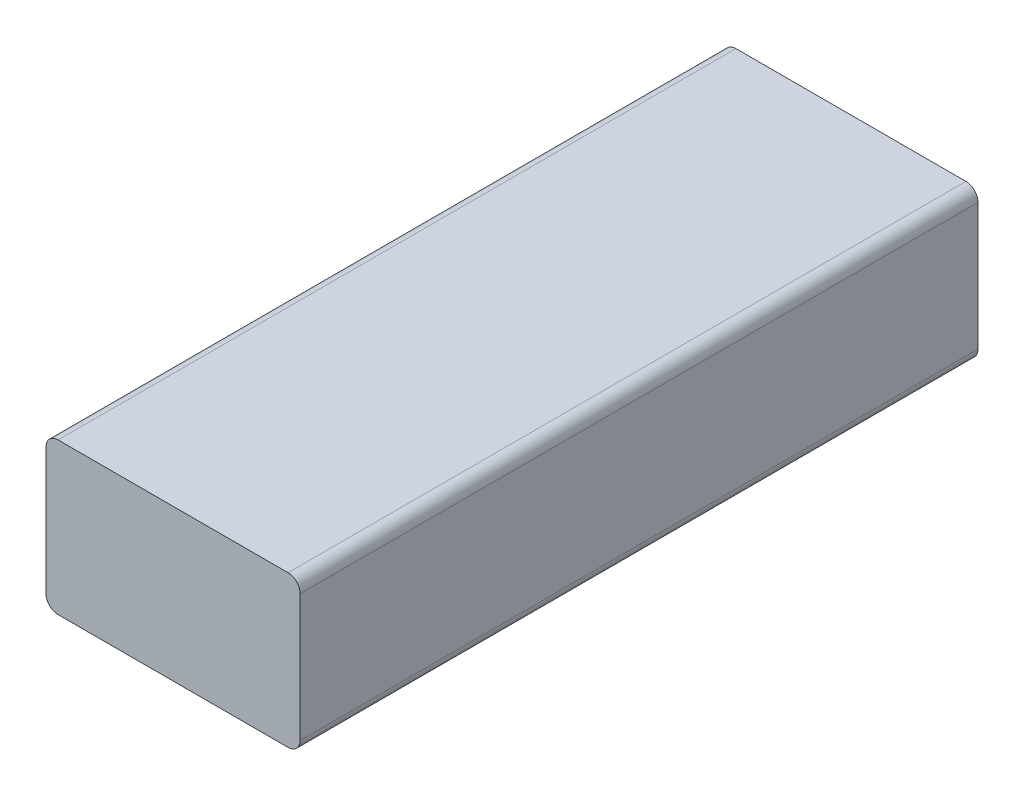
ISO-10303-21;
HEADER;
FILE_DESCRIPTION(('STEP AP214'),'2;1');
FILE_NAME('part.step','',(''),(''),'','','');
FILE_SCHEMA(('AUTOMOTIVE_DESIGN { 1 0 10303 214 1 1 1 1 }'));
ENDSEC;
DATA;
#1=APPLICATION_CONTEXT('core data for automotive mechanical design processes');
#2=APPLICATION_PROTOCOL_DEFINITION('international standard','automotive_design',2000,#1);
#3=PRODUCT_CONTEXT('',#1,'mechanical');
#4=PRODUCT('Part','Part','',(#3));
#5=PRODUCT_RELATED_PRODUCT_CATEGORY('part','',(#4));
#6=PRODUCT_DEFINITION_FORMATION('','',#4);
#7=PRODUCT_DEFINITION_CONTEXT('part definition',#1,'design');
#8=PRODUCT_DEFINITION('design','',#6,#7);
#9=PRODUCT_DEFINITION_SHAPE('','',#8);
#10=(LENGTH_UNIT() NAMED_UNIT(*) SI_UNIT(.MILLI.,.METRE.));
#11=(NAMED_UNIT(*) PLANE_ANGLE_UNIT() SI_UNIT($,.RADIAN.));
#12=(NAMED_UNIT(*) SI_UNIT($,.STERADIAN.) SOLID_ANGLE_UNIT());
#13=UNCERTAINTY_MEASURE_WITH_UNIT(LENGTH_MEASURE(1.E-05),#10,'distance_accuracy_value','');
#14=(GEOMETRIC_REPRESENTATION_CONTEXT(3) GLOBAL_UNCERTAINTY_ASSIGNED_CONTEXT((#13)) GLOBAL_UNIT_ASSIGNED_CONTEXT((#10,
#11,#12)) REPRESENTATION_CONTEXT('',''));
#15=CARTESIAN_POINT('',(0.,0.,0.));
#16=DIRECTION('',(0.,0.,1.));
#17=DIRECTION('',(1.,0.,0.));
#18=AXIS2_PLACEMENT_3D('',#15,#16,#17);
#19=CARTESIAN_POINT('',(-29.3402777777778,15.8854166666667,-112.));
#20=DIRECTION('',(-1.,0.,0.));
#21=DIRECTION('',(0.,0.,1.));
#22=AXIS2_PLACEMENT_3D('',#19,#20,#21);
#23=PLANE('',#22);
#24=DIRECTION('',(0.,-1.,0.));
#25=VECTOR('',#24,1.);
#26=CARTESIAN_POINT('',(-29.3402777777778,15.8854166666667,-112.));
#27=LINE('',#26,#25);
#28=CARTESIAN_POINT('',(-29.3402777777778,13.8854166666667,-112.));
#29=VERTEX_POINT('',#28);
#30=CARTESIAN_POINT('',(-29.3402777777778,-7.11458333333333,-112.));
#31=VERTEX_POINT('',#30);
#32=EDGE_CURVE('E179',#29,#31,#27,.T.);
#33=ORIENTED_EDGE('',*,*,#32,.T.);
#34=DIRECTION('',(0.,0.,1.));
#35=VECTOR('',#34,1.);
#36=CARTESIAN_POINT('',(-29.3402777777778,-7.11458333333333,-112.));
#37=LINE('',#36,#35);
#38=CARTESIAN_POINT('',(-29.3402777777778,-7.11458333333333,0.));
#39=VERTEX_POINT('',#38);
#40=EDGE_CURVE('E11',#31,#39,#37,.T.);
#41=ORIENTED_EDGE('',*,*,#40,.T.);
#42=DIRECTION('',(0.,-1.,0.));
#43=VECTOR('',#42,1.);
#44=CARTESIAN_POINT('',(-29.3402777777778,15.8854166666667,0.));
#45=LINE('',#44,#43);
#46=CARTESIAN_POINT('',(-29.3402777777778,13.8854166666667,0.));
#47=VERTEX_POINT('',#46);
#48=EDGE_CURVE('E112',#47,#39,#45,.T.);
#49=ORIENTED_EDGE('',*,*,#48,.F.);
#50=DIRECTION('',(0.,0.,1.));
#51=VECTOR('',#50,1.);
#52=CARTESIAN_POINT('',(-29.3402777777778,13.8854166666667,-112.));
#53=LINE('',#52,#51);
#54=EDGE_CURVE('E48',#47,#29,#53,.F.);
#55=ORIENTED_EDGE('',*,*,#54,.T.);
#56=EDGE_LOOP('',(#33,#41,#49,#55));
#57=FACE_BOUND('',#56,.T.);
#58=ADVANCED_FACE('F39',(#57),#23,.T.);
#59=CARTESIAN_POINT('',(-29.3402777777778,15.8854166666667,-112.));
#60=DIRECTION('',(0.,1.,0.));
#61=DIRECTION('',(0.,0.,1.));
#62=AXIS2_PLACEMENT_3D('',#59,#60,#61);
#63=PLANE('',#62);
#64=DIRECTION('',(-1.,0.,0.));
#65=VECTOR('',#64,1.);
#66=CARTESIAN_POINT('',(-29.3402777777778,15.8854166666667,0.));
#67=LINE('',#66,#65);
#68=CARTESIAN_POINT('',(10.6597222222222,15.8854166666667,0.));
#69=VERTEX_POINT('',#68);
#70=CARTESIAN_POINT('',(-27.3402777777778,15.8854166666667,0.));
#71=VERTEX_POINT('',#70);
#72=EDGE_CURVE('E143',#69,#71,#67,.T.);
#73=ORIENTED_EDGE('',*,*,#72,.F.);
#74=DIRECTION('',(0.,0.,1.));
#75=VECTOR('',#74,1.);
#76=CARTESIAN_POINT('',(10.6597222222222,15.8854166666667,-112.));
#77=LINE('',#76,#75);
#78=CARTESIAN_POINT('',(10.6597222222222,15.8854166666667,-112.));
#79=VERTEX_POINT('',#78);
#80=EDGE_CURVE('E62',#69,#79,#77,.F.);
#81=ORIENTED_EDGE('',*,*,#80,.T.);
#82=DIRECTION('',(-1.,0.,0.));
#83=VECTOR('',#82,1.);
#84=CARTESIAN_POINT('',(-29.3402777777778,15.8854166666667,-112.));
#85=LINE('',#84,#83);
#86=CARTESIAN_POINT('',(-27.3402777777778,15.8854166666667,-112.));
#87=VERTEX_POINT('',#86);
#88=EDGE_CURVE('E135',#79,#87,#85,.T.);
#89=ORIENTED_EDGE('',*,*,#88,.T.);
#90=DIRECTION('',(0.,0.,1.));
#91=VECTOR('',#90,1.);
#92=CARTESIAN_POINT('',(-27.3402777777778,15.8854166666667,-112.));
#93=LINE('',#92,#91);
#94=EDGE_CURVE('E170',#87,#71,#93,.T.);
#95=ORIENTED_EDGE('',*,*,#94,.T.);
#96=EDGE_LOOP('',(#73,#81,#89,#95));
#97=FACE_BOUND('',#96,.T.);
#98=ADVANCED_FACE('F188',(#97),#63,.T.);
#99=CARTESIAN_POINT('',(12.6597222222222,15.8854166666667,-112.));
#100=DIRECTION('',(1.,0.,0.));
#101=DIRECTION('',(0.,0.,-1.));
#102=AXIS2_PLACEMENT_3D('',#99,#100,#101);
#103=PLANE('',#102);
#104=DIRECTION('',(0.,1.,0.));
#105=VECTOR('',#104,1.);
#106=CARTESIAN_POINT('',(12.6597222222222,15.8854166666667,0.));
#107=LINE('',#106,#105);
#108=CARTESIAN_POINT('',(12.6597222222222,-7.11458333333333,0.));
#109=VERTEX_POINT('',#108);
#110=CARTESIAN_POINT('',(12.6597222222222,13.8854166666667,0.));
#111=VERTEX_POINT('',#110);
#112=EDGE_CURVE('E129',#109,#111,#107,.T.);
#113=ORIENTED_EDGE('',*,*,#112,.F.);
#114=DIRECTION('',(0.,0.,1.));
#115=VECTOR('',#114,1.);
#116=CARTESIAN_POINT('',(12.6597222222222,-7.11458333333333,-112.));
#117=LINE('',#116,#115);
#118=CARTESIAN_POINT('',(12.6597222222222,-7.11458333333333,-112.));
#119=VERTEX_POINT('',#118);
#120=EDGE_CURVE('E157',#109,#119,#117,.F.);
#121=ORIENTED_EDGE('',*,*,#120,.T.);
#122=DIRECTION('',(0.,1.,0.));
#123=VECTOR('',#122,1.);
#124=CARTESIAN_POINT('',(12.6597222222222,15.8854166666667,-112.));
#125=LINE('',#124,#123);
#126=CARTESIAN_POINT('',(12.6597222222222,13.8854166666667,-112.));
#127=VERTEX_POINT('',#126);
#128=EDGE_CURVE('E140',#119,#127,#125,.T.);
#129=ORIENTED_EDGE('',*,*,#128,.T.);
#130=DIRECTION('',(0.,0.,1.));
#131=VECTOR('',#130,1.);
#132=CARTESIAN_POINT('',(12.6597222222222,13.8854166666667,-112.));
#133=LINE('',#132,#131);
#134=EDGE_CURVE('E153',#127,#111,#133,.T.);
#135=ORIENTED_EDGE('',*,*,#134,.T.);
#136=EDGE_LOOP('',(#113,#121,#129,#135));
#137=FACE_BOUND('',#136,.T.);
#138=ADVANCED_FACE('F205',(#137),#103,.T.);
#139=CARTESIAN_POINT('',(-29.3402777777778,-9.11458333333333,-112.));
#140=DIRECTION('',(0.,-1.,0.));
#141=DIRECTION('',(0.,0.,-1.));
#142=AXIS2_PLACEMENT_3D('',#139,#140,#141);
#143=PLANE('',#142);
#144=DIRECTION('',(1.,0.,0.));
#145=VECTOR('',#144,1.);
#146=CARTESIAN_POINT('',(-29.3402777777778,-9.11458333333333,-112.));
#147=LINE('',#146,#145);
#148=CARTESIAN_POINT('',(-27.3402777777778,-9.11458333333333,-112.));
#149=VERTEX_POINT('',#148);
#150=CARTESIAN_POINT('',(10.6597222222222,-9.11458333333333,-112.));
#151=VERTEX_POINT('',#150);
#152=EDGE_CURVE('E184',#149,#151,#147,.T.);
#153=ORIENTED_EDGE('',*,*,#152,.T.);
#154=DIRECTION('',(0.,0.,1.));
#155=VECTOR('',#154,1.);
#156=CARTESIAN_POINT('',(10.6597222222222,-9.11458333333333,-112.));
#157=LINE('',#156,#155);
#158=CARTESIAN_POINT('',(10.6597222222222,-9.11458333333333,0.));
#159=VERTEX_POINT('',#158);
#160=EDGE_CURVE('E127',#151,#159,#157,.T.);
#161=ORIENTED_EDGE('',*,*,#160,.T.);
#162=DIRECTION('',(1.,0.,0.));
#163=VECTOR('',#162,1.);
#164=CARTESIAN_POINT('',(-29.3402777777778,-9.11458333333333,0.));
#165=LINE('',#164,#163);
#166=CARTESIAN_POINT('',(-27.3402777777778,-9.11458333333333,0.));
#167=VERTEX_POINT('',#166);
#168=EDGE_CURVE('E110',#167,#159,#165,.T.);
#169=ORIENTED_EDGE('',*,*,#168,.F.);
#170=DIRECTION('',(0.,0.,1.));
#171=VECTOR('',#170,1.);
#172=CARTESIAN_POINT('',(-27.3402777777778,-9.11458333333333,-112.));
#173=LINE('',#172,#171);
#174=EDGE_CURVE('E124',#167,#149,#173,.F.);
#175=ORIENTED_EDGE('',*,*,#174,.T.);
#176=EDGE_LOOP('',(#153,#161,#169,#175));
#177=FACE_BOUND('',#176,.T.);
#178=ADVANCED_FACE('F123',(#177),#143,.T.);
#179=CARTESIAN_POINT('',(0.,0.,-112.));
#180=DIRECTION('',(0.,0.,1.));
#181=DIRECTION('',(1.,0.,0.));
#182=AXIS2_PLACEMENT_3D('',#179,#180,#181);
#183=PLANE('',#182);
#184=ORIENTED_EDGE('',*,*,#128,.F.);
#185=CARTESIAN_POINT('',(10.6597222222222,-7.11458333333333,-112.));
#186=DIRECTION('',(0.,0.,1.));
#187=DIRECTION('',(1.,0.,0.));
#188=AXIS2_PLACEMENT_3D('',#185,#186,#187);
#189=CIRCLE('',#188,2.);
#190=EDGE_CURVE('E167',#119,#151,#189,.F.);
#191=ORIENTED_EDGE('',*,*,#190,.T.);
#192=ORIENTED_EDGE('',*,*,#152,.F.);
#193=CARTESIAN_POINT('',(-27.3402777777778,-7.11458333333333,-112.));
#194=DIRECTION('',(0.,0.,1.));
#195=DIRECTION('',(1.,0.,0.));
#196=AXIS2_PLACEMENT_3D('',#193,#194,#195);
#197=CIRCLE('',#196,2.);
#198=EDGE_CURVE('E133',#149,#31,#197,.F.);
#199=ORIENTED_EDGE('',*,*,#198,.T.);
#200=ORIENTED_EDGE('',*,*,#32,.F.);
#201=CARTESIAN_POINT('',(-27.3402777777778,13.8854166666667,-112.));
#202=DIRECTION('',(0.,0.,1.));
#203=DIRECTION('',(1.,0.,0.));
#204=AXIS2_PLACEMENT_3D('',#201,#202,#203);
#205=CIRCLE('',#204,2.);
#206=EDGE_CURVE('E55',#29,#87,#205,.F.);
#207=ORIENTED_EDGE('',*,*,#206,.T.);
#208=ORIENTED_EDGE('',*,*,#88,.F.);
#209=CARTESIAN_POINT('',(10.6597222222222,13.8854166666667,-112.));
#210=DIRECTION('',(0.,0.,1.));
#211=DIRECTION('',(1.,0.,0.));
#212=AXIS2_PLACEMENT_3D('',#209,#210,#211);
#213=CIRCLE('',#212,2.);
#214=EDGE_CURVE('E164',#79,#127,#213,.F.);
#215=ORIENTED_EDGE('',*,*,#214,.T.);
#216=EDGE_LOOP('',(#184,#191,#192,#199,#200,#207,#208,#215));
#217=FACE_BOUND('',#216,.T.);
#218=ADVANCED_FACE('F182',(#217),#183,.F.);
#219=CARTESIAN_POINT('',(0.,0.,0.));
#220=DIRECTION('',(0.,0.,1.));
#221=DIRECTION('',(1.,0.,0.));
#222=AXIS2_PLACEMENT_3D('',#219,#220,#221);
#223=PLANE('',#222);
#224=ORIENTED_EDGE('',*,*,#168,.T.);
#225=CARTESIAN_POINT('',(10.6597222222222,-7.11458333333333,0.));
#226=DIRECTION('',(0.,0.,1.));
#227=DIRECTION('',(1.,0.,0.));
#228=AXIS2_PLACEMENT_3D('',#225,#226,#227);
#229=CIRCLE('',#228,2.);
#230=EDGE_CURVE('E150',#159,#109,#229,.T.);
#231=ORIENTED_EDGE('',*,*,#230,.T.);
#232=ORIENTED_EDGE('',*,*,#112,.T.);
#233=CARTESIAN_POINT('',(10.6597222222222,13.8854166666667,0.));
#234=DIRECTION('',(0.,0.,1.));
#235=DIRECTION('',(1.,0.,0.));
#236=AXIS2_PLACEMENT_3D('',#233,#234,#235);
#237=CIRCLE('',#236,2.);
#238=EDGE_CURVE('E117',#111,#69,#237,.T.);
#239=ORIENTED_EDGE('',*,*,#238,.T.);
#240=ORIENTED_EDGE('',*,*,#72,.T.);
#241=CARTESIAN_POINT('',(-27.3402777777778,13.8854166666667,0.));
#242=DIRECTION('',(0.,0.,1.));
#243=DIRECTION('',(1.,0.,0.));
#244=AXIS2_PLACEMENT_3D('',#241,#242,#243);
#245=CIRCLE('',#244,2.);
#246=EDGE_CURVE('E118',#71,#47,#245,.T.);
#247=ORIENTED_EDGE('',*,*,#246,.T.);
#248=ORIENTED_EDGE('',*,*,#48,.T.);
#249=CARTESIAN_POINT('',(-27.3402777777778,-7.11458333333333,0.));
#250=DIRECTION('',(0.,0.,1.));
#251=DIRECTION('',(1.,0.,0.));
#252=AXIS2_PLACEMENT_3D('',#249,#250,#251);
#253=CIRCLE('',#252,2.);
#254=EDGE_CURVE('E107',#39,#167,#253,.T.);
#255=ORIENTED_EDGE('',*,*,#254,.T.);
#256=EDGE_LOOP('',(#224,#231,#232,#239,#240,#247,#248,#255));
#257=FACE_BOUND('',#256,.T.);
#258=ADVANCED_FACE('F109',(#257),#223,.T.);
#259=CARTESIAN_POINT('',(10.6597222222222,-7.11458333333333,-112.));
#260=DIRECTION('',(0.,0.,1.));
#261=DIRECTION('',(1.,0.,0.));
#262=AXIS2_PLACEMENT_3D('',#259,#260,#261);
#263=CYLINDRICAL_SURFACE('',#262,2.);
#264=ORIENTED_EDGE('',*,*,#190,.F.);
#265=ORIENTED_EDGE('',*,*,#120,.F.);
#266=ORIENTED_EDGE('',*,*,#230,.F.);
#267=ORIENTED_EDGE('',*,*,#160,.F.);
#268=EDGE_LOOP('',(#264,#265,#266,#267));
#269=FACE_BOUND('',#268,.T.);
#270=ADVANCED_FACE('F202',(#269),#263,.T.);
#271=CARTESIAN_POINT('',(10.6597222222222,13.8854166666667,-112.));
#272=DIRECTION('',(0.,0.,1.));
#273=DIRECTION('',(1.,0.,0.));
#274=AXIS2_PLACEMENT_3D('',#271,#272,#273);
#275=CYLINDRICAL_SURFACE('',#274,2.);
#276=ORIENTED_EDGE('',*,*,#214,.F.);
#277=ORIENTED_EDGE('',*,*,#80,.F.);
#278=ORIENTED_EDGE('',*,*,#238,.F.);
#279=ORIENTED_EDGE('',*,*,#134,.F.);
#280=EDGE_LOOP('',(#276,#277,#278,#279));
#281=FACE_BOUND('',#280,.T.);
#282=ADVANCED_FACE('F209',(#281),#275,.T.);
#283=CARTESIAN_POINT('',(-27.3402777777778,-7.11458333333333,-112.));
#284=DIRECTION('',(0.,0.,1.));
#285=DIRECTION('',(1.,0.,0.));
#286=AXIS2_PLACEMENT_3D('',#283,#284,#285);
#287=CYLINDRICAL_SURFACE('',#286,2.);
#288=ORIENTED_EDGE('',*,*,#198,.F.);
#289=ORIENTED_EDGE('',*,*,#174,.F.);
#290=ORIENTED_EDGE('',*,*,#254,.F.);
#291=ORIENTED_EDGE('',*,*,#40,.F.);
#292=EDGE_LOOP('',(#288,#289,#290,#291));
#293=FACE_BOUND('',#292,.T.);
#294=ADVANCED_FACE('F132',(#293),#287,.T.);
#295=CARTESIAN_POINT('',(-27.3402777777778,13.8854166666667,-112.));
#296=DIRECTION('',(0.,0.,1.));
#297=DIRECTION('',(1.,0.,0.));
#298=AXIS2_PLACEMENT_3D('',#295,#296,#297);
#299=CYLINDRICAL_SURFACE('',#298,2.);
#300=ORIENTED_EDGE('',*,*,#206,.F.);
#301=ORIENTED_EDGE('',*,*,#54,.F.);
#302=ORIENTED_EDGE('',*,*,#246,.F.);
#303=ORIENTED_EDGE('',*,*,#94,.F.);
#304=EDGE_LOOP('',(#300,#301,#302,#303));
#305=FACE_BOUND('',#304,.T.);
#306=ADVANCED_FACE('F41',(#305),#299,.T.);
#307=CLOSED_SHELL('',(#58,#98,#138,#178,#218,#258,#270,#282,#294,#306));
#308=MANIFOLD_SOLID_BREP('B2',#307);
#309=ADVANCED_BREP_SHAPE_REPRESENTATION('',(#18,#308),#14);
#310=SHAPE_DEFINITION_REPRESENTATION(#9,#309);
ENDSEC;
END-ISO-10303-21;
